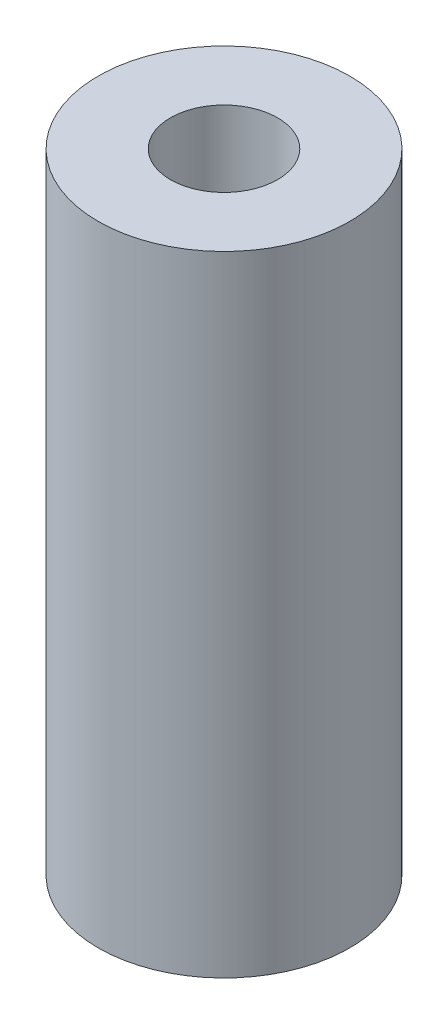
ISO-10303-21;
HEADER;
FILE_DESCRIPTION(('STEP AP214'),'2;1');
FILE_NAME('part.step','',(''),(''),'','','');
FILE_SCHEMA(('AUTOMOTIVE_DESIGN { 1 0 10303 214 1 1 1 1 }'));
ENDSEC;
DATA;
#1=APPLICATION_CONTEXT('core data for automotive mechanical design processes');
#2=APPLICATION_PROTOCOL_DEFINITION('international standard','automotive_design',2000,#1);
#3=PRODUCT_CONTEXT('',#1,'mechanical');
#4=PRODUCT('Part','Part','',(#3));
#5=PRODUCT_RELATED_PRODUCT_CATEGORY('part','',(#4));
#6=PRODUCT_DEFINITION_FORMATION('','',#4);
#7=PRODUCT_DEFINITION_CONTEXT('part definition',#1,'design');
#8=PRODUCT_DEFINITION('design','',#6,#7);
#9=PRODUCT_DEFINITION_SHAPE('','',#8);
#10=(LENGTH_UNIT() NAMED_UNIT(*) SI_UNIT(.MILLI.,.METRE.));
#11=(NAMED_UNIT(*) PLANE_ANGLE_UNIT() SI_UNIT($,.RADIAN.));
#12=(NAMED_UNIT(*) SI_UNIT($,.STERADIAN.) SOLID_ANGLE_UNIT());
#13=UNCERTAINTY_MEASURE_WITH_UNIT(LENGTH_MEASURE(1.E-05),#10,'distance_accuracy_value','');
#14=(GEOMETRIC_REPRESENTATION_CONTEXT(3) GLOBAL_UNCERTAINTY_ASSIGNED_CONTEXT((#13)) GLOBAL_UNIT_ASSIGNED_CONTEXT((#10,
#11,#12)) REPRESENTATION_CONTEXT('',''));
#15=CARTESIAN_POINT('',(0.,0.,0.));
#16=DIRECTION('',(0.,0.,1.));
#17=DIRECTION('',(1.,0.,0.));
#18=AXIS2_PLACEMENT_3D('',#15,#16,#17);
#19=CARTESIAN_POINT('',(0.,15.875,0.));
#20=DIRECTION('',(0.,-1.,0.));
#21=DIRECTION('',(0.,0.,-1.));
#22=AXIS2_PLACEMENT_3D('',#19,#20,#21);
#23=CYLINDRICAL_SURFACE('',#22,3.175);
#24=CARTESIAN_POINT('',(0.,15.875,0.));
#25=DIRECTION('',(0.,1.,0.));
#26=DIRECTION('',(0.,0.,1.));
#27=AXIS2_PLACEMENT_3D('',#24,#25,#26);
#28=CIRCLE('',#27,3.175);
#29=CARTESIAN_POINT('',(0.,15.875,3.175));
#30=VERTEX_POINT('',#29);
#31=EDGE_CURVE('E10',#30,#30,#28,.T.);
#32=ORIENTED_EDGE('',*,*,#31,.F.);
#33=EDGE_LOOP('',(#32));
#34=FACE_BOUND('',#33,.T.);
#35=CARTESIAN_POINT('',(0.,0.,0.));
#36=DIRECTION('',(0.,1.,0.));
#37=DIRECTION('',(0.,0.,1.));
#38=AXIS2_PLACEMENT_3D('',#35,#36,#37);
#39=CIRCLE('',#38,3.175);
#40=CARTESIAN_POINT('',(0.,0.,3.175));
#41=VERTEX_POINT('',#40);
#42=EDGE_CURVE('E34',#41,#41,#39,.T.);
#43=ORIENTED_EDGE('',*,*,#42,.T.);
#44=EDGE_LOOP('',(#43));
#45=FACE_BOUND('',#44,.T.);
#46=ADVANCED_FACE('F31',(#34,#45),#23,.T.);
#47=CARTESIAN_POINT('',(0.,15.875,0.));
#48=DIRECTION('',(0.,1.,0.));
#49=DIRECTION('',(0.,0.,1.));
#50=AXIS2_PLACEMENT_3D('',#47,#48,#49);
#51=PLANE('',#50);
#52=CARTESIAN_POINT('',(0.,15.875,0.));
#53=DIRECTION('',(0.,1.,0.));
#54=DIRECTION('',(0.,0.,1.));
#55=AXIS2_PLACEMENT_3D('',#52,#53,#54);
#56=CIRCLE('',#55,1.35254999999999);
#57=CARTESIAN_POINT('',(0.,15.875,1.35254999999999));
#58=VERTEX_POINT('',#57);
#59=EDGE_CURVE('E45',#58,#58,#56,.T.);
#60=ORIENTED_EDGE('',*,*,#59,.F.);
#61=EDGE_LOOP('',(#60));
#62=FACE_BOUND('',#61,.T.);
#63=ORIENTED_EDGE('',*,*,#31,.T.);
#64=EDGE_LOOP('',(#63));
#65=FACE_BOUND('',#64,.T.);
#66=ADVANCED_FACE('F51',(#62,#65),#51,.T.);
#67=CARTESIAN_POINT('',(0.,0.,0.));
#68=DIRECTION('',(0.,1.,0.));
#69=DIRECTION('',(0.,0.,1.));
#70=AXIS2_PLACEMENT_3D('',#67,#68,#69);
#71=PLANE('',#70);
#72=CARTESIAN_POINT('',(0.,0.,0.));
#73=DIRECTION('',(0.,1.,0.));
#74=DIRECTION('',(0.,0.,1.));
#75=AXIS2_PLACEMENT_3D('',#72,#73,#74);
#76=CIRCLE('',#75,1.35255);
#77=CARTESIAN_POINT('',(0.,0.,1.35255));
#78=VERTEX_POINT('',#77);
#79=EDGE_CURVE('E41',#78,#78,#76,.T.);
#80=ORIENTED_EDGE('',*,*,#79,.T.);
#81=EDGE_LOOP('',(#80));
#82=FACE_BOUND('',#81,.T.);
#83=ORIENTED_EDGE('',*,*,#42,.F.);
#84=EDGE_LOOP('',(#83));
#85=FACE_BOUND('',#84,.T.);
#86=ADVANCED_FACE('F53',(#82,#85),#71,.F.);
#87=CARTESIAN_POINT('',(0.,15.875,0.));
#88=DIRECTION('',(0.,1.,0.));
#89=DIRECTION('',(0.,0.,1.));
#90=AXIS2_PLACEMENT_3D('',#87,#88,#89);
#91=CYLINDRICAL_SURFACE('',#90,1.35254999999999);
#92=ORIENTED_EDGE('',*,*,#79,.F.);
#93=EDGE_LOOP('',(#92));
#94=FACE_BOUND('',#93,.T.);
#95=ORIENTED_EDGE('',*,*,#59,.T.);
#96=EDGE_LOOP('',(#95));
#97=FACE_BOUND('',#96,.T.);
#98=ADVANCED_FACE('F49',(#94,#97),#91,.F.);
#99=CLOSED_SHELL('',(#46,#66,#86,#98));
#100=MANIFOLD_SOLID_BREP('B2',#99);
#101=ADVANCED_BREP_SHAPE_REPRESENTATION('',(#18,#100),#14);
#102=SHAPE_DEFINITION_REPRESENTATION(#9,#101);
ENDSEC;
END-ISO-10303-21;
